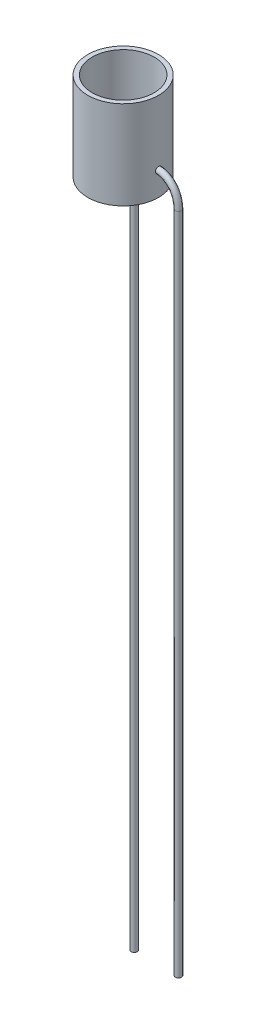
ISO-10303-21;
HEADER;
FILE_DESCRIPTION(('STEP AP214'),'2;1');
FILE_NAME('part.step','',(''),(''),'','','');
FILE_SCHEMA(('AUTOMOTIVE_DESIGN { 1 0 10303 214 1 1 1 1 }'));
ENDSEC;
DATA;
#1=APPLICATION_CONTEXT('core data for automotive mechanical design processes');
#2=APPLICATION_PROTOCOL_DEFINITION('international standard','automotive_design',2000,#1);
#3=PRODUCT_CONTEXT('',#1,'mechanical');
#4=PRODUCT('Part','Part','',(#3));
#5=PRODUCT_RELATED_PRODUCT_CATEGORY('part','',(#4));
#6=PRODUCT_DEFINITION_FORMATION('','',#4);
#7=PRODUCT_DEFINITION_CONTEXT('part definition',#1,'design');
#8=PRODUCT_DEFINITION('design','',#6,#7);
#9=PRODUCT_DEFINITION_SHAPE('','',#8);
#10=(LENGTH_UNIT() NAMED_UNIT(*) SI_UNIT(.MILLI.,.METRE.));
#11=(NAMED_UNIT(*) PLANE_ANGLE_UNIT() SI_UNIT($,.RADIAN.));
#12=(NAMED_UNIT(*) SI_UNIT($,.STERADIAN.) SOLID_ANGLE_UNIT());
#13=UNCERTAINTY_MEASURE_WITH_UNIT(LENGTH_MEASURE(1.E-05),#10,'distance_accuracy_value','');
#14=(GEOMETRIC_REPRESENTATION_CONTEXT(3) GLOBAL_UNCERTAINTY_ASSIGNED_CONTEXT((#13)) GLOBAL_UNIT_ASSIGNED_CONTEXT((#10,
#11,#12)) REPRESENTATION_CONTEXT('',''));
#15=CARTESIAN_POINT('',(0.,0.,0.));
#16=DIRECTION('',(0.,0.,1.));
#17=DIRECTION('',(1.,0.,0.));
#18=AXIS2_PLACEMENT_3D('',#15,#16,#17);
#19=CARTESIAN_POINT('',(0.,10.,0.));
#20=DIRECTION('',(0.,1.,0.));
#21=DIRECTION('',(0.,0.,1.));
#22=AXIS2_PLACEMENT_3D('',#19,#20,#21);
#23=PLANE('',#22);
#24=CARTESIAN_POINT('',(0.,10.,0.));
#25=DIRECTION('',(0.,1.,0.));
#26=DIRECTION('',(0.,0.,1.));
#27=AXIS2_PLACEMENT_3D('',#24,#25,#26);
#28=CIRCLE('',#27,4.);
#29=CARTESIAN_POINT('',(0.,10.,4.));
#30=VERTEX_POINT('',#29);
#31=EDGE_CURVE('E213',#30,#30,#28,.T.);
#32=ORIENTED_EDGE('',*,*,#31,.T.);
#33=EDGE_LOOP('',(#32));
#34=FACE_BOUND('',#33,.T.);
#35=CARTESIAN_POINT('',(0.,10.,0.));
#36=DIRECTION('',(0.,1.,0.));
#37=DIRECTION('',(0.,0.,1.));
#38=AXIS2_PLACEMENT_3D('',#35,#36,#37);
#39=CIRCLE('',#38,3.5);
#40=CARTESIAN_POINT('',(0.,10.,3.5));
#41=VERTEX_POINT('',#40);
#42=EDGE_CURVE('E201',#41,#41,#39,.T.);
#43=ORIENTED_EDGE('',*,*,#42,.F.);
#44=EDGE_LOOP('',(#43));
#45=FACE_BOUND('',#44,.T.);
#46=ADVANCED_FACE('F79',(#34,#45),#23,.T.);
#47=CARTESIAN_POINT('',(0.,0.,0.));
#48=DIRECTION('',(0.,1.,0.));
#49=DIRECTION('',(0.,0.,1.));
#50=AXIS2_PLACEMENT_3D('',#47,#48,#49);
#51=PLANE('',#50);
#52=CARTESIAN_POINT('',(0.,0.,0.));
#53=DIRECTION('',(0.,1.,0.));
#54=DIRECTION('',(0.,0.,1.));
#55=AXIS2_PLACEMENT_3D('',#52,#53,#54);
#56=CIRCLE('',#55,4.);
#57=CARTESIAN_POINT('',(0.,0.,4.));
#58=VERTEX_POINT('',#57);
#59=EDGE_CURVE('E195',#58,#58,#56,.T.);
#60=ORIENTED_EDGE('',*,*,#59,.F.);
#61=EDGE_LOOP('',(#60));
#62=FACE_BOUND('',#61,.T.);
#63=CARTESIAN_POINT('',(0.,0.,0.));
#64=DIRECTION('',(0.,1.,0.));
#65=DIRECTION('',(0.,0.,1.));
#66=AXIS2_PLACEMENT_3D('',#63,#64,#65);
#67=CIRCLE('',#66,3.5);
#68=CARTESIAN_POINT('',(0.,0.,3.5));
#69=VERTEX_POINT('',#68);
#70=EDGE_CURVE('E198',#69,#69,#67,.T.);
#71=ORIENTED_EDGE('',*,*,#70,.T.);
#72=EDGE_LOOP('',(#71));
#73=FACE_BOUND('',#72,.T.);
#74=ADVANCED_FACE('F185',(#62,#73),#51,.F.);
#75=CARTESIAN_POINT('',(0.,10.,0.));
#76=DIRECTION('',(0.,-1.,0.));
#77=DIRECTION('',(0.,0.,-1.));
#78=AXIS2_PLACEMENT_3D('',#75,#76,#77);
#79=CYLINDRICAL_SURFACE('',#78,4.);
#80=CARTESIAN_POINT('',(3.9971760908696,3.01608341763562,-0.150277405597149));
#81=CARTESIAN_POINT('',(3.99730501337618,3.01771504290608,-0.146848029907377));
#82=CARTESIAN_POINT('',(3.99743186316323,3.01929082479754,-0.143392012815305));
#83=CARTESIAN_POINT('',(3.99767826594509,3.02229732791861,-0.136503203947613));
#84=CARTESIAN_POINT('',(3.99779791607632,3.02373039429681,-0.133071438987918));
#85=CARTESIAN_POINT('',(3.99802972232847,3.02645723343541,-0.126237038832907));
#86=CARTESIAN_POINT('',(3.99814198354394,3.02775331504892,-0.122835328319405));
#87=CARTESIAN_POINT('',(3.99835881751661,3.03021208701379,-0.116066362928009));
#88=CARTESIAN_POINT('',(3.99846350353768,3.03137704222626,-0.112699934039069));
#89=CARTESIAN_POINT('',(3.99866501354683,3.03357952123922,-0.106006223741513));
#90=CARTESIAN_POINT('',(3.99876195875962,3.03461925974917,-0.102679675289815));
#91=CARTESIAN_POINT('',(3.99894781983196,3.03657724208781,-0.0960700483382276));
#92=CARTESIAN_POINT('',(3.99903686494143,3.03749764603359,-0.0927876106741892));
#93=CARTESIAN_POINT('',(3.99928894058844,3.04005694003333,-0.083118753921174));
#94=CARTESIAN_POINT('',(3.99944339556055,3.04156398791493,-0.0766966349568579));
#95=CARTESIAN_POINT('',(3.99971803020037,3.0441541830987,-0.0640626276444427));
#96=CARTESIAN_POINT('',(3.99983942221278,3.04525311025412,-0.0578539784708236));
#97=CARTESIAN_POINT('',(4.00004707321248,3.04707247648924,-0.0456636113333542));
#98=CARTESIAN_POINT('',(4.00013465672064,3.0478075993034,-0.03968410955108));
#99=CARTESIAN_POINT('',(4.00027400232167,3.04894208758759,-0.0279634931279527));
#100=CARTESIAN_POINT('',(4.00032719399919,3.04935502505389,-0.0222237058922852));
#101=CARTESIAN_POINT('',(4.00039722945095,3.04988503939368,-0.0109888820907363));
#102=CARTESIAN_POINT('',(4.00041559956728,3.05001458067727,-0.00549444104551672));
#103=CARTESIAN_POINT('',(4.00041559956728,3.05001458067728,0.00549444104491611));
#104=CARTESIAN_POINT('',(4.00039722945095,3.0498850393937,0.0109888820901293));
#105=CARTESIAN_POINT('',(4.00032719399919,3.04935502505392,0.0222237058916713));
#106=CARTESIAN_POINT('',(4.00027400232167,3.04894208758764,0.0279634931273385));
#107=CARTESIAN_POINT('',(4.00013465672064,3.04780759930347,0.0396841095504716));
#108=CARTESIAN_POINT('',(4.00004707321248,3.04707247648932,0.0456636113327521));
#109=CARTESIAN_POINT('',(3.99983942221278,3.04525311025422,0.0578539784702419));
#110=CARTESIAN_POINT('',(3.99971803020037,3.04415418309881,0.0640626276438753));
#111=CARTESIAN_POINT('',(3.99944339556055,3.04156398791505,0.0766966349563266));
#112=CARTESIAN_POINT('',(3.99928894058844,3.04005694003345,0.0831187539206647));
#113=CARTESIAN_POINT('',(3.99903686494143,3.03749764603372,0.0927876106737166));
#114=CARTESIAN_POINT('',(3.99894781983196,3.03657724208794,0.0960700483377696));
#115=CARTESIAN_POINT('',(3.99876195875962,3.0346192597493,0.102679675289387));
#116=CARTESIAN_POINT('',(3.99866501354683,3.03357952123935,0.106006223741102));
#117=CARTESIAN_POINT('',(3.99846350353768,3.03137704222639,0.112699934038694));
#118=CARTESIAN_POINT('',(3.99835881751661,3.03021208701392,0.116066362927653));
#119=CARTESIAN_POINT('',(3.99814198354394,3.02775331504904,0.122835328319088));
#120=CARTESIAN_POINT('',(3.99802972232847,3.02645723343552,0.126237038832611));
#121=CARTESIAN_POINT('',(3.99779791607632,3.02373039429691,0.133071438987666));
#122=CARTESIAN_POINT('',(3.99767826594509,3.02229732791871,0.136503203947384));
#123=CARTESIAN_POINT('',(3.99743186316323,3.01929082479762,0.143392012815125));
#124=CARTESIAN_POINT('',(3.99730501337618,3.01771504290616,0.146848029907223));
#125=CARTESIAN_POINT('',(3.9971760908696,3.01608341763568,0.150277405597019));
#126=B_SPLINE_CURVE_WITH_KNOTS('',3,(#80,#81,#82,#83,#84,#85,#86,#87,#88,#89,#90,#91,#92,#93,
#94,#95,#96,#97,#98,#99,#100,#101,#102,#103,#104,#105,#106,#107,#108,#109,#110,#111,#112,#113,
#114,#115,#116,#117,#118,#119,#120,#121,#122,#123,#124,#125),.UNSPECIFIED.,.F.,.F.,(4,2,2,2,2,2,
2,2,2,2,2,2,2,2,2,2,2,2,2,2,2,2,4),(0.,0.0113992620830471,0.0225600350643871,0.0334842130492008,
0.0441740745869729,0.0546322422527145,0.0648616440960258,0.0846451876017054,0.103555137027942,
0.121622436963278,0.138879954448029,0.155361758685704,0.17184356292336,0.189101080408108,
0.207168380343459,0.226078329769732,0.245861873275474,0.256091275118825,0.266549442784615,
0.277239304322442,0.28816348230732,0.299324255288731,0.310723517371859),.UNSPECIFIED.);
#127=CARTESIAN_POINT('',(3.9971760908696,3.01608341763562,-0.150277405597149));
#128=VERTEX_POINT('',#127);
#129=CARTESIAN_POINT('',(3.99717609086867,3.01608341773927,0.150277405379116));
#130=VERTEX_POINT('',#129);
#131=EDGE_CURVE('E102',#128,#130,#126,.T.);
#132=ORIENTED_EDGE('',*,*,#131,.F.);
#133=CARTESIAN_POINT('',(0.,450.424629994595,0.));
#134=DIRECTION('',(-0.999960093649076,-0.0089337063601897,0.));
#135=DIRECTION('',(0.00893370636018971,-0.999960093649077,0.));
#136=AXIS2_PLACEMENT_3D('',#133,#134,#135);
#137=ELLIPSE('',#136,447.742497763836,4.);
#138=EDGE_CURVE('E172',#128,#130,#137,.T.);
#139=ORIENTED_EDGE('',*,*,#138,.T.);
#140=EDGE_LOOP('',(#132,#139));
#141=FACE_BOUND('',#140,.T.);
#142=ORIENTED_EDGE('',*,*,#31,.F.);
#143=EDGE_LOOP('',(#142));
#144=FACE_BOUND('',#143,.T.);
#145=ORIENTED_EDGE('',*,*,#59,.T.);
#146=EDGE_LOOP('',(#145));
#147=FACE_BOUND('',#146,.T.);
#148=ADVANCED_FACE('F81',(#141,#144,#147),#79,.T.);
#149=CARTESIAN_POINT('',(0.,10.,0.));
#150=DIRECTION('',(0.,-1.,0.));
#151=DIRECTION('',(0.,0.,-1.));
#152=AXIS2_PLACEMENT_3D('',#149,#150,#151);
#153=CYLINDRICAL_SURFACE('',#152,3.5);
#154=CARTESIAN_POINT('',(0.,-389.059051245272,0.));
#155=DIRECTION('',(0.999960093649076,-0.0089337063601897,0.));
#156=DIRECTION('',(-0.00893370636018971,-0.999960093649077,0.));
#157=AXIS2_PLACEMENT_3D('',#154,#155,#156);
#158=ELLIPSE('',#157,391.774685543356,3.5);
#159=CARTESIAN_POINT('',(3.49713998481959,2.37987519039253,-0.141463516805388));
#160=VERTEX_POINT('',#159);
#161=CARTESIAN_POINT('',(3.49713998481933,2.37987519036197,0.141463516736221));
#162=VERTEX_POINT('',#161);
#163=EDGE_CURVE('E14',#160,#162,#158,.T.);
#164=ORIENTED_EDGE('',*,*,#163,.F.);
#165=CARTESIAN_POINT('',(3.49713998481933,2.37987519036197,-0.141463516736221));
#166=CARTESIAN_POINT('',(3.49641311973341,2.38783837054161,-0.159508412683636));
#167=CARTESIAN_POINT('',(3.49556832073754,2.39735003126079,-0.176856833672244));
#168=CARTESIAN_POINT('',(3.49375008100583,2.41913062272189,-0.20970273652657));
#169=CARTESIAN_POINT('',(3.49277673031144,2.43139762771394,-0.225201499615086));
#170=CARTESIAN_POINT('',(3.49080691849732,2.45836650944345,-0.25392209797482));
#171=CARTESIAN_POINT('',(3.4898104484931,2.47306933602565,-0.267143040894845));
#172=CARTESIAN_POINT('',(3.48790813468016,2.50448715558617,-0.290928082551201));
#173=CARTESIAN_POINT('',(3.48700227341296,2.52120175956284,-0.301492693705133));
#174=CARTESIAN_POINT('',(3.48538380936835,2.55616939375767,-0.319661322795987));
#175=CARTESIAN_POINT('',(3.48467112485733,2.57442176904231,-0.327266593433003));
#176=CARTESIAN_POINT('',(3.4835191258438,2.61197957253674,-0.339310209245403));
#177=CARTESIAN_POINT('',(3.48308018725699,2.63128640939393,-0.34374420075057));
#178=CARTESIAN_POINT('',(3.48252939390202,2.67025610034607,-0.349280446569962));
#179=CARTESIAN_POINT('',(3.48241556094805,2.68991606560185,-0.350402852436409));
#180=CARTESIAN_POINT('',(3.48252233664206,2.72917287335268,-0.349340019028147));
#181=CARTESIAN_POINT('',(3.48274340695147,2.7487695913276,-0.347150213903737));
#182=CARTESIAN_POINT('',(3.48349406977725,2.78723713127761,-0.339534152955996));
#183=CARTESIAN_POINT('',(3.48402245247756,2.80611049212077,-0.334120586333364));
#184=CARTESIAN_POINT('',(3.485328082182,2.84270726924761,-0.320213523312456));
#185=CARTESIAN_POINT('',(3.48610567989268,2.86042902241228,-0.31171568434199));
#186=CARTESIAN_POINT('',(3.48782345850425,2.89422363621772,-0.29186726074657));
#187=CARTESIAN_POINT('',(3.48876388923805,2.91029390172013,-0.280512280126145));
#188=CARTESIAN_POINT('',(3.49070248203753,2.94032709790911,-0.255257421321269));
#189=CARTESIAN_POINT('',(3.4917007242265,2.95428700216963,-0.241353950403578));
#190=CARTESIAN_POINT('',(3.49364395185432,2.97970756967771,-0.211370861637876));
#191=CARTESIAN_POINT('',(3.49458882269497,2.99116299614351,-0.195286795810994));
#192=CARTESIAN_POINT('',(3.49631809752934,3.01122740370512,-0.16139293857045));
#193=CARTESIAN_POINT('',(3.49710227605624,3.01983239565551,-0.143580773369476));
#194=CARTESIAN_POINT('',(3.49841837894003,3.03390929763564,-0.106800474076423));
#195=CARTESIAN_POINT('',(3.49895092301918,3.03938891178039,-0.0878353111035873));
#196=CARTESIAN_POINT('',(3.49970717266349,3.04709466044039,-0.0492225597339007));
#197=CARTESIAN_POINT('',(3.49993046882844,3.04931648233053,-0.0295741019387828));
#198=CARTESIAN_POINT('',(3.50004140813807,3.05042553603034,0.00973149734662721));
#199=CARTESIAN_POINT('',(3.49993051148175,3.04932727431748,0.0293882269288969));
#200=CARTESIAN_POINT('',(3.49938869448978,3.04385958412705,0.0682368367176737));
#201=CARTESIAN_POINT('',(3.49895777198034,3.03949013342968,0.087428713765721));
#202=CARTESIAN_POINT('',(3.49782410813539,3.02760545253956,0.124805407277661));
#203=CARTESIAN_POINT('',(3.49712134296527,3.0200899465025,0.14299013527696));
#204=CARTESIAN_POINT('',(3.49552359358967,3.0021395748315,0.177816335203868));
#205=CARTESIAN_POINT('',(3.49462886337821,2.99170856131444,0.194459805150663));
#206=CARTESIAN_POINT('',(3.49274160854251,2.96815964757876,0.225842345424679));
#207=CARTESIAN_POINT('',(3.49174863634106,2.95502912604913,0.240571919423689));
#208=CARTESIAN_POINT('',(3.48978135941691,2.92650185742042,0.267600215758772));
#209=CARTESIAN_POINT('',(3.48880703062174,2.91110829199924,0.279902295011114));
#210=CARTESIAN_POINT('',(3.48698167083527,2.87841263783117,0.301795218569781));
#211=CARTESIAN_POINT('',(3.48613109704924,2.8611038681641,0.311376127829702));
#212=CARTESIAN_POINT('',(3.48465518505763,2.82513886477611,0.327481141873452));
#213=CARTESIAN_POINT('',(3.48402952693019,2.80648459065452,0.334009592507705));
#214=CARTESIAN_POINT('',(3.48307369799313,2.76836038900628,0.343834528736355));
#215=CARTESIAN_POINT('',(3.48274316444405,2.74889149364889,0.347134982359515));
#216=CARTESIAN_POINT('',(3.48241434646232,2.70970079803516,0.350418493363375));
#217=CARTESIAN_POINT('',(3.48241559261703,2.68997939456639,0.350406237671816));
#218=CARTESIAN_POINT('',(3.4827486555892,2.65086640216277,0.347079960014239));
#219=CARTESIAN_POINT('',(3.48307970238093,2.63147415197722,0.343773629125936));
#220=CARTESIAN_POINT('',(3.48403292399082,2.59354877028686,0.333973857164576));
#221=CARTESIAN_POINT('',(3.48465469974726,2.57501449930464,0.327484784205345));
#222=CARTESIAN_POINT('',(3.48612099443545,2.53925038389101,0.311488000971883));
#223=CARTESIAN_POINT('',(3.48696608347062,2.5220240254764,0.301972551724645));
#224=CARTESIAN_POINT('',(3.48878182546763,2.4894322234671,0.280213943068956));
#225=CARTESIAN_POINT('',(3.48975230271,2.47406423282249,0.267974583933877));
#226=CARTESIAN_POINT('',(3.49171804037355,2.44549200151893,0.241016433419564));
#227=CARTESIAN_POINT('',(3.49271342305377,2.43230290295749,0.22628162314746));
#228=CARTESIAN_POINT('',(3.4946086871668,2.40860656243452,0.194823752234159));
#229=CARTESIAN_POINT('',(3.49550876160507,2.39809383753271,0.178104861057599));
#230=CARTESIAN_POINT('',(3.49660119278214,2.38580453115297,0.154340169788179));
#231=CARTESIAN_POINT('',(3.49687809480565,2.38273989397463,0.147944351084856));
#232=CARTESIAN_POINT('',(3.49713998481783,2.379875190362,0.141463516736222));
#233=B_SPLINE_CURVE_WITH_KNOTS('',3,(#165,#166,#167,#168,#169,#170,#171,#172,#173,#174,#175,
#176,#177,#178,#179,#180,#181,#182,#183,#184,#185,#186,#187,#188,#189,#190,#191,#192,#193,#194,
#195,#196,#197,#198,#199,#200,#201,#202,#203,#204,#205,#206,#207,#208,#209,#210,#211,#212,#213,
#214,#215,#216,#217,#218,#219,#220,#221,#222,#223,#224,#225,#226,#227,#228,#229,#230,#231,#232),
.UNSPECIFIED.,.F.,.F.,(4,2,2,2,2,2,2,2,2,2,2,2,2,2,2,2,2,2,2,2,2,2,2,2,2,2,2,2,2,2,2,2,2,4),(0.,
0.0591309646609729,0.118220729727189,0.177333591223469,0.236435040835772,0.295511445292909,
0.354668797545025,0.413465417296736,0.472343161499521,0.530990671997719,0.589721078984953,
0.648542407054653,0.707447305301486,0.766474218145635,0.825583392768466,0.884546225359056,
0.943587041968814,1.00237026429653,1.06115388591731,1.11994266273197,1.17865412904467,
1.23764660663437,1.29655692444191,1.35567963848382,1.41471792000378,1.47368353691428,
1.53256572780977,1.59131076072586,1.64997539442067,1.70879126658135,1.76752559030244,
1.8266523210623,1.88565692929579,1.90693534135172),.UNSPECIFIED.);
#234=EDGE_CURVE('E89',#160,#162,#233,.T.);
#235=ORIENTED_EDGE('',*,*,#234,.T.);
#236=EDGE_LOOP('',(#164,#235));
#237=FACE_BOUND('',#236,.T.);
#238=ORIENTED_EDGE('',*,*,#42,.T.);
#239=EDGE_LOOP('',(#238));
#240=FACE_BOUND('',#239,.T.);
#241=ORIENTED_EDGE('',*,*,#70,.F.);
#242=EDGE_LOOP('',(#241));
#243=FACE_BOUND('',#242,.T.);
#244=ADVANCED_FACE('F175',(#237,#240,#243),#153,.F.);
#245=CARTESIAN_POINT('',(4.00312679722606,2.35001396722283,0.));
#246=CARTESIAN_POINT('',(4.49630172679606,2.35442000609369,0.));
#247=CARTESIAN_POINT('',(5.05279713639593,2.03312431049072,0.));
#248=CARTESIAN_POINT('',(5.72683063785073,1.16293002815025,0.));
#249=CARTESIAN_POINT('',(5.86977564463308,0.593551876176314,0.));
#250=CARTESIAN_POINT('',(5.89861600491484,-0.0165271573682457,0.));
#251=CARTESIAN_POINT('',(4.00312679722606,2.35001396722283,0.699999999999999));
#252=CARTESIAN_POINT('',(4.49630172679606,2.35442000609369,0.699999999999999));
#253=CARTESIAN_POINT('',(5.05279713639593,2.03312431049072,0.699999999999999));
#254=CARTESIAN_POINT('',(5.72683063785073,1.16293002815025,0.699999999999999));
#255=CARTESIAN_POINT('',(5.86977564463308,0.593551876176314,0.699999999999999));
#256=CARTESIAN_POINT('',(5.89861600491484,-0.0165271573682457,0.699999999999999));
#257=CARTESIAN_POINT('',(3.99687320277392,3.04998603277718,0.699999999999999));
#258=CARTESIAN_POINT('',(4.77437716948156,3.05693222320592,0.699999999999999));
#259=CARTESIAN_POINT('',(5.48730049632128,2.61528176735913,0.699999999999999));
#260=CARTESIAN_POINT('',(6.4004067221726,1.4364385471804,0.699999999999999));
#261=CARTESIAN_POINT('',(6.56485327159529,0.714214565580555,0.699999999999999));
#262=CARTESIAN_POINT('',(6.59783514958788,0.0165271573682874,0.699999999999999));
#263=CARTESIAN_POINT('',(3.99687320277392,3.04998603277718,0.));
#264=CARTESIAN_POINT('',(4.77437716948156,3.05693222320592,0.));
#265=CARTESIAN_POINT('',(5.48730049632128,2.61528176735913,0.));
#266=CARTESIAN_POINT('',(6.4004067221726,1.43643854718039,0.));
#267=CARTESIAN_POINT('',(6.56485327159529,0.714214565580555,0.));
#268=CARTESIAN_POINT('',(6.59783514958788,0.0165271573682874,0.));
#269=CARTESIAN_POINT('',(3.99687320277392,3.04998603277718,-0.699999999999999));
#270=CARTESIAN_POINT('',(4.77437716948156,3.05693222320592,-0.699999999999999));
#271=CARTESIAN_POINT('',(5.48730049632128,2.61528176735913,-0.699999999999999));
#272=CARTESIAN_POINT('',(6.4004067221726,1.4364385471804,-0.699999999999999));
#273=CARTESIAN_POINT('',(6.56485327159529,0.714214565580555,-0.699999999999999));
#274=CARTESIAN_POINT('',(6.59783514958788,0.0165271573682874,-0.699999999999999));
#275=CARTESIAN_POINT('',(4.00312679722606,2.35001396722283,-0.699999999999999));
#276=CARTESIAN_POINT('',(4.49630172679606,2.35442000609369,-0.699999999999999));
#277=CARTESIAN_POINT('',(5.05279713639593,2.03312431049072,-0.699999999999999));
#278=CARTESIAN_POINT('',(5.72683063785073,1.16293002815025,-0.699999999999999));
#279=CARTESIAN_POINT('',(5.86977564463308,0.593551876176314,-0.699999999999999));
#280=CARTESIAN_POINT('',(5.89861600491484,-0.0165271573682457,-0.699999999999999));
#281=CARTESIAN_POINT('',(4.00312679722606,2.35001396722283,0.));
#282=CARTESIAN_POINT('',(4.49630172679606,2.35442000609369,0.));
#283=CARTESIAN_POINT('',(5.05279713639593,2.03312431049072,0.));
#284=CARTESIAN_POINT('',(5.72683063785073,1.16293002815025,0.));
#285=CARTESIAN_POINT('',(5.86977564463308,0.593551876176314,0.));
#286=CARTESIAN_POINT('',(5.89861600491484,-0.0165271573682457,0.));
#287=(BOUNDED_SURFACE() B_SPLINE_SURFACE(3,3,((#245,#246,#247,#248,#249,#250),(#251,#252,#253,
#254,#255,#256),(#257,#258,#259,#260,#261,#262),(#263,#264,#265,#266,#267,#268),(#269,#270,#271,
#272,#273,#274),(#275,#276,#277,#278,#279,#280),(#281,#282,#283,#284,#285,#286)),.UNSPECIFIED.,
.T.,.F.,.F.) B_SPLINE_SURFACE_WITH_KNOTS((4,3,4),(4,2,4),(0.,0.5,1.),(0.,0.497339000249792,1.),
.UNSPECIFIED.) GEOMETRIC_REPRESENTATION_ITEM() RATIONAL_B_SPLINE_SURFACE(((1.,1.,1.,1.,1.,1.),
(0.333333333333333,0.333333333333333,0.333333333333333,0.333333333333333,0.333333333333333,
0.333333333333333),(0.333333333333333,0.333333333333333,0.333333333333333,0.333333333333333,
0.333333333333333,0.333333333333333),(1.,1.,1.,1.,1.,1.),(0.333333333333333,0.333333333333333,
0.333333333333333,0.333333333333333,0.333333333333333,0.333333333333333),(0.333333333333333,
0.333333333333333,0.333333333333333,0.333333333333333,0.333333333333333,0.333333333333333),(1.,
1.,1.,1.,1.,1.))) REPRESENTATION_ITEM('') SURFACE());
#288=CARTESIAN_POINT('',(6.24822557725136,0.,0.));
#289=DIRECTION('',(-0.0472204496236252,0.998884492390057,0.));
#290=DIRECTION('',(-0.998884492390057,-0.0472204496236252,0.));
#291=AXIS2_PLACEMENT_3D('',#288,#289,#290);
#292=CIRCLE('',#291,0.35);
#293=CARTESIAN_POINT('',(5.8984207910831,-0.00826357868412519,0.));
#294=VERTEX_POINT('',#293);
#295=EDGE_CURVE('E202',#294,#294,#292,.T.);
#296=CARTESIAN_POINT('',(3.99999999999999,2.7,0.));
#297=DIRECTION('',(-0.999960093649076,-0.0089337063601897,0.));
#298=DIRECTION('',(0.0089337063601897,-0.999960093649076,0.));
#299=AXIS2_PLACEMENT_3D('',#296,#297,#298);
#300=CIRCLE('',#299,0.35);
#301=CARTESIAN_POINT('',(4.00312679722606,2.35001396722282,0.));
#302=VERTEX_POINT('',#301);
#303=EDGE_CURVE('E233',#128,#302,#300,.T.);
#304=EDGE_CURVE('E209',#302,#130,#300,.T.);
#305=ORIENTED_EDGE('',*,*,#295,.T.);
#306=EDGE_LOOP('',(#305));
#307=FACE_BOUND('',#306,.T.);
#308=ORIENTED_EDGE('',*,*,#303,.F.);
#309=ORIENTED_EDGE('',*,*,#131,.T.);
#310=ORIENTED_EDGE('',*,*,#304,.F.);
#311=EDGE_LOOP('',(#308,#309,#310));
#312=FACE_BOUND('',#311,.T.);
#313=ADVANCED_FACE('F180',(#307,#312),#287,.F.);
#314=CARTESIAN_POINT('',(6.24822557725137,-75.,0.));
#315=DIRECTION('',(0.,1.,0.));
#316=DIRECTION('',(-1.,0.,0.));
#317=AXIS2_PLACEMENT_3D('',#314,#315,#316);
#318=PLANE('',#317);
#319=CARTESIAN_POINT('',(6.24822557725137,-75.,0.));
#320=DIRECTION('',(0.,1.,0.));
#321=DIRECTION('',(-1.,0.,0.));
#322=AXIS2_PLACEMENT_3D('',#319,#320,#321);
#323=CIRCLE('',#322,0.35);
#324=CARTESIAN_POINT('',(5.89822557725137,-75.,0.));
#325=VERTEX_POINT('',#324);
#326=EDGE_CURVE('E133',#325,#325,#323,.T.);
#327=ORIENTED_EDGE('',*,*,#326,.F.);
#328=EDGE_LOOP('',(#327));
#329=FACE_BOUND('',#328,.T.);
#330=ADVANCED_FACE('F182',(#329),#318,.F.);
#331=CARTESIAN_POINT('',(3.99999999999999,2.7,0.));
#332=DIRECTION('',(-0.999960093649076,-0.0089337063601897,0.));
#333=DIRECTION('',(0.0089337063601897,-0.999960093649076,0.));
#334=AXIS2_PLACEMENT_3D('',#331,#332,#333);
#335=PLANE('',#334);
#336=ORIENTED_EDGE('',*,*,#138,.F.);
#337=ORIENTED_EDGE('',*,*,#303,.T.);
#338=ORIENTED_EDGE('',*,*,#304,.T.);
#339=EDGE_LOOP('',(#336,#337,#338));
#340=FACE_BOUND('',#339,.T.);
#341=ADVANCED_FACE('F256',(#340),#335,.T.);
#342=CARTESIAN_POINT('',(6.24822557725136,0.,0.));
#343=DIRECTION('',(0.,-1.,0.));
#344=DIRECTION('',(1.,0.,0.));
#345=AXIS2_PLACEMENT_3D('',#342,#343,#344);
#346=CYLINDRICAL_SURFACE('',#345,0.35);
#347=ORIENTED_EDGE('',*,*,#326,.T.);
#348=EDGE_LOOP('',(#347));
#349=FACE_BOUND('',#348,.T.);
#350=ORIENTED_EDGE('',*,*,#295,.F.);
#351=EDGE_LOOP('',(#350));
#352=FACE_BOUND('',#351,.T.);
#353=ADVANCED_FACE('F249',(#349,#352),#346,.T.);
#354=CARTESIAN_POINT('',(3.5,2.7,0.));
#355=DIRECTION('',(0.999960093649076,-0.0089337063601897,0.));
#356=DIRECTION('',(-0.0089337063601897,-0.999960093649076,0.));
#357=AXIS2_PLACEMENT_3D('',#354,#355,#356);
#358=PLANE('',#357);
#359=CARTESIAN_POINT('',(3.5,2.7,0.));
#360=DIRECTION('',(-0.999960093649076,0.0089337063601897,0.));
#361=DIRECTION('',(-0.0089337063601897,-0.999960093649076,0.));
#362=AXIS2_PLACEMENT_3D('',#359,#360,#361);
#363=CIRCLE('',#362,0.35);
#364=CARTESIAN_POINT('',(3.49687320277394,2.35001396722283,0.));
#365=VERTEX_POINT('',#364);
#366=EDGE_CURVE('E134',#365,#160,#363,.F.);
#367=ORIENTED_EDGE('',*,*,#366,.T.);
#368=ORIENTED_EDGE('',*,*,#163,.T.);
#369=EDGE_CURVE('E96',#162,#365,#363,.F.);
#370=ORIENTED_EDGE('',*,*,#369,.T.);
#371=EDGE_LOOP('',(#367,#368,#370));
#372=FACE_BOUND('',#371,.T.);
#373=ADVANCED_FACE('F155',(#372),#358,.T.);
#374=CARTESIAN_POINT('',(1.25177442274863,-75.,0.));
#375=DIRECTION('',(0.,1.,0.));
#376=DIRECTION('',(1.,0.,0.));
#377=AXIS2_PLACEMENT_3D('',#374,#375,#376);
#378=PLANE('',#377);
#379=CARTESIAN_POINT('',(1.25177442274863,-75.,0.));
#380=DIRECTION('',(0.,-1.,0.));
#381=DIRECTION('',(1.,0.,0.));
#382=AXIS2_PLACEMENT_3D('',#379,#380,#381);
#383=CIRCLE('',#382,0.35);
#384=CARTESIAN_POINT('',(1.60177442274863,-75.,0.));
#385=VERTEX_POINT('',#384);
#386=EDGE_CURVE('E228',#385,#385,#383,.F.);
#387=ORIENTED_EDGE('',*,*,#386,.F.);
#388=EDGE_LOOP('',(#387));
#389=FACE_BOUND('',#388,.T.);
#390=ADVANCED_FACE('F248',(#389),#378,.F.);
#391=CARTESIAN_POINT('',(1.25177442274864,0.,0.));
#392=DIRECTION('',(0.,-1.,0.));
#393=DIRECTION('',(1.,0.,0.));
#394=AXIS2_PLACEMENT_3D('',#391,#392,#393);
#395=CYLINDRICAL_SURFACE('',#394,0.35);
#396=ORIENTED_EDGE('',*,*,#386,.T.);
#397=EDGE_LOOP('',(#396));
#398=FACE_BOUND('',#397,.T.);
#399=CARTESIAN_POINT('',(1.25177442274864,0.,0.));
#400=DIRECTION('',(-0.0472204496236252,-0.998884492390057,0.));
#401=DIRECTION('',(0.998884492390057,-0.0472204496236252,0.));
#402=AXIS2_PLACEMENT_3D('',#399,#400,#401);
#403=CIRCLE('',#402,0.35);
#404=CARTESIAN_POINT('',(1.6015792089169,-0.00826357868413212,0.));
#405=VERTEX_POINT('',#404);
#406=EDGE_CURVE('E127',#405,#405,#403,.F.);
#407=ORIENTED_EDGE('',*,*,#406,.F.);
#408=EDGE_LOOP('',(#407));
#409=FACE_BOUND('',#408,.T.);
#410=ADVANCED_FACE('F154',(#398,#409),#395,.T.);
#411=CARTESIAN_POINT('',(3.49687320277395,2.35001396722283,0.));
#412=CARTESIAN_POINT('',(3.00369827321277,2.35442000609424,0.));
#413=CARTESIAN_POINT('',(2.44720286360854,2.03312431049518,0.));
#414=CARTESIAN_POINT('',(1.77316936214475,1.16293002814572,0.));
#415=CARTESIAN_POINT('',(1.63022435536848,0.593551876158131,0.));
#416=CARTESIAN_POINT('',(1.60138399508516,-0.0165271573682596,0.));
#417=CARTESIAN_POINT('',(3.49687320277395,2.35001396722283,-0.699999999999999));
#418=CARTESIAN_POINT('',(3.00369827321277,2.35442000609424,-0.699999999999999));
#419=CARTESIAN_POINT('',(2.44720286360854,2.03312431049518,-0.699999999999999));
#420=CARTESIAN_POINT('',(1.77316936214475,1.16293002814572,-0.699999999999999));
#421=CARTESIAN_POINT('',(1.63022435536848,0.593551876158131,-0.699999999999999));
#422=CARTESIAN_POINT('',(1.60138399508516,-0.0165271573682596,-0.699999999999999));
#423=CARTESIAN_POINT('',(3.50312679722607,3.04998603277718,-0.699999999999999));
#424=CARTESIAN_POINT('',(2.72562283054048,3.05693222320634,-0.699999999999999));
#425=CARTESIAN_POINT('',(2.01269950368095,2.61528176735913,-0.699999999999999));
#426=CARTESIAN_POINT('',(1.09959327782513,1.43643854718039,-0.699999999999999));
#427=CARTESIAN_POINT('',(0.935146728408259,0.714214565562372,-0.699999999999999));
#428=CARTESIAN_POINT('',(0.90216485041212,0.0165271573682735,-0.699999999999999));
#429=CARTESIAN_POINT('',(3.50312679722607,3.04998603277718,0.));
#430=CARTESIAN_POINT('',(2.72562283054048,3.05693222320661,0.));
#431=CARTESIAN_POINT('',(2.01269950368095,2.61528176735913,0.));
#432=CARTESIAN_POINT('',(1.09959327782513,1.43643854718039,0.));
#433=CARTESIAN_POINT('',(0.935146728408259,0.714214565562372,0.));
#434=CARTESIAN_POINT('',(0.902164850412121,0.0165271573682735,0.));
#435=CARTESIAN_POINT('',(3.50312679722607,3.04998603277718,0.699999999999999));
#436=CARTESIAN_POINT('',(2.72562283054048,3.05693222320689,0.699999999999999));
#437=CARTESIAN_POINT('',(2.01269950368095,2.61528176735913,0.699999999999999));
#438=CARTESIAN_POINT('',(1.09959327782513,1.43643854718039,0.699999999999999));
#439=CARTESIAN_POINT('',(0.935146728408259,0.714214565562372,0.699999999999999));
#440=CARTESIAN_POINT('',(0.902164850412121,0.0165271573682735,0.699999999999999));
#441=CARTESIAN_POINT('',(3.49687320277395,2.35001396722283,0.699999999999999));
#442=CARTESIAN_POINT('',(3.00369827321277,2.35442000609424,0.699999999999999));
#443=CARTESIAN_POINT('',(2.44720286360854,2.03312431049518,0.699999999999999));
#444=CARTESIAN_POINT('',(1.77316936214475,1.16293002814572,0.699999999999999));
#445=CARTESIAN_POINT('',(1.63022435536848,0.593551876158131,0.699999999999999));
#446=CARTESIAN_POINT('',(1.60138399508516,-0.0165271573682596,0.699999999999999));
#447=CARTESIAN_POINT('',(3.49687320277395,2.35001396722283,0.));
#448=CARTESIAN_POINT('',(3.00369827321277,2.35442000609424,0.));
#449=CARTESIAN_POINT('',(2.44720286360854,2.03312431049518,0.));
#450=CARTESIAN_POINT('',(1.77316936214475,1.16293002814572,0.));
#451=CARTESIAN_POINT('',(1.63022435536848,0.593551876158131,0.));
#452=CARTESIAN_POINT('',(1.60138399508516,-0.0165271573682596,0.));
#453=(BOUNDED_SURFACE() B_SPLINE_SURFACE(3,3,((#411,#412,#413,#414,#415,#416),(#417,#418,#419,
#420,#421,#422),(#423,#424,#425,#426,#427,#428),(#429,#430,#431,#432,#433,#434),(#435,#436,#437,
#438,#439,#440),(#441,#442,#443,#444,#445,#446),(#447,#448,#449,#450,#451,#452)),.UNSPECIFIED.,
.T.,.F.,.F.) B_SPLINE_SURFACE_WITH_KNOTS((4,3,4),(4,2,4),(0.,0.5,1.),(0.,0.497339000249792,1.),
.UNSPECIFIED.) GEOMETRIC_REPRESENTATION_ITEM() RATIONAL_B_SPLINE_SURFACE(((1.,1.,1.,1.,1.,1.),
(0.333333333333333,0.333333333333333,0.333333333333333,0.333333333333333,0.333333333333333,
0.333333333333333),(0.333333333333333,0.333333333333333,0.333333333333333,0.333333333333333,
0.333333333333333,0.333333333333333),(1.,1.,1.,1.,1.,1.),(0.333333333333333,0.333333333333333,
0.333333333333333,0.333333333333333,0.333333333333333,0.333333333333333),(0.333333333333333,
0.333333333333333,0.333333333333333,0.333333333333333,0.333333333333333,0.333333333333333),(1.,
1.,1.,1.,1.,1.))) REPRESENTATION_ITEM('') SURFACE());
#454=ORIENTED_EDGE('',*,*,#234,.F.);
#455=ORIENTED_EDGE('',*,*,#366,.F.);
#456=ORIENTED_EDGE('',*,*,#369,.F.);
#457=EDGE_LOOP('',(#454,#455,#456));
#458=FACE_BOUND('',#457,.T.);
#459=ORIENTED_EDGE('',*,*,#406,.T.);
#460=EDGE_LOOP('',(#459));
#461=FACE_BOUND('',#460,.T.);
#462=ADVANCED_FACE('F129',(#458,#461),#453,.F.);
#463=CLOSED_SHELL('',(#46,#74,#148,#244,#313,#330,#341,#353,#373,#390,#410,#462));
#464=MANIFOLD_SOLID_BREP('B2',#463);
#465=ADVANCED_BREP_SHAPE_REPRESENTATION('',(#18,#464),#14);
#466=SHAPE_DEFINITION_REPRESENTATION(#9,#465);
ENDSEC;
END-ISO-10303-21;
